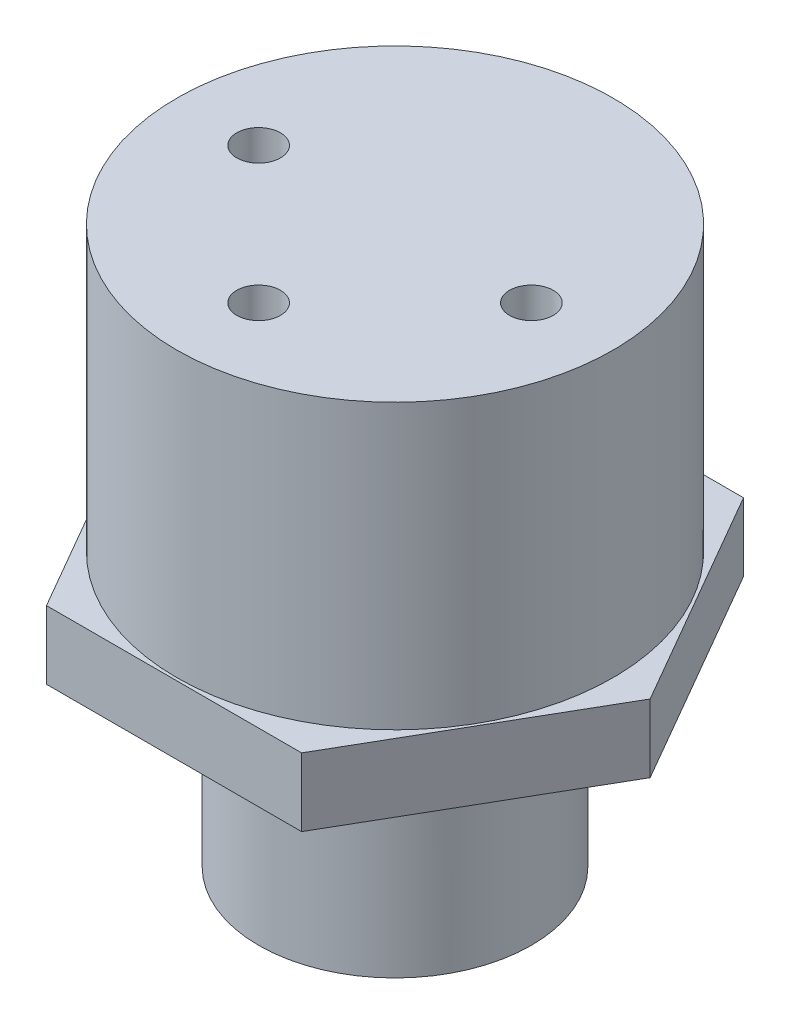
ISO-10303-21;
HEADER;
FILE_DESCRIPTION(('STEP AP214'),'2;1');
FILE_NAME('part.step','',(''),(''),'','','');
FILE_SCHEMA(('AUTOMOTIVE_DESIGN { 1 0 10303 214 1 1 1 1 }'));
ENDSEC;
DATA;
#1=APPLICATION_CONTEXT('core data for automotive mechanical design processes');
#2=APPLICATION_PROTOCOL_DEFINITION('international standard','automotive_design',2000,#1);
#3=PRODUCT_CONTEXT('',#1,'mechanical');
#4=PRODUCT('Part','Part','',(#3));
#5=PRODUCT_RELATED_PRODUCT_CATEGORY('part','',(#4));
#6=PRODUCT_DEFINITION_FORMATION('','',#4);
#7=PRODUCT_DEFINITION_CONTEXT('part definition',#1,'design');
#8=PRODUCT_DEFINITION('design','',#6,#7);
#9=PRODUCT_DEFINITION_SHAPE('','',#8);
#10=(LENGTH_UNIT() NAMED_UNIT(*) SI_UNIT(.MILLI.,.METRE.));
#11=(NAMED_UNIT(*) PLANE_ANGLE_UNIT() SI_UNIT($,.RADIAN.));
#12=(NAMED_UNIT(*) SI_UNIT($,.STERADIAN.) SOLID_ANGLE_UNIT());
#13=UNCERTAINTY_MEASURE_WITH_UNIT(LENGTH_MEASURE(1.E-05),#10,'distance_accuracy_value','');
#14=(GEOMETRIC_REPRESENTATION_CONTEXT(3) GLOBAL_UNCERTAINTY_ASSIGNED_CONTEXT((#13)) GLOBAL_UNIT_ASSIGNED_CONTEXT((#10,
#11,#12)) REPRESENTATION_CONTEXT('',''));
#15=CARTESIAN_POINT('',(0.,0.,0.));
#16=DIRECTION('',(0.,0.,1.));
#17=DIRECTION('',(1.,0.,0.));
#18=AXIS2_PLACEMENT_3D('',#15,#16,#17);
#19=CARTESIAN_POINT('',(0.,26.416,0.));
#20=DIRECTION('',(0.,1.,0.));
#21=DIRECTION('',(0.,0.,1.));
#22=AXIS2_PLACEMENT_3D('',#19,#20,#21);
#23=PLANE('',#22);
#24=CARTESIAN_POINT('',(-12.7,26.416,0.));
#25=DIRECTION('',(0.,1.,0.));
#26=DIRECTION('',(0.,0.,1.));
#27=AXIS2_PLACEMENT_3D('',#24,#25,#26);
#28=CIRCLE('',#27,2.032);
#29=CARTESIAN_POINT('',(-12.7,26.416,2.032));
#30=VERTEX_POINT('',#29);
#31=EDGE_CURVE('E205',#30,#30,#28,.T.);
#32=ORIENTED_EDGE('',*,*,#31,.F.);
#33=EDGE_LOOP('',(#32));
#34=FACE_BOUND('',#33,.T.);
#35=CARTESIAN_POINT('',(0.,26.416,0.));
#36=DIRECTION('',(0.,1.,0.));
#37=DIRECTION('',(0.,0.,1.));
#38=AXIS2_PLACEMENT_3D('',#35,#36,#37);
#39=CIRCLE('',#38,20.32);
#40=CARTESIAN_POINT('',(0.,26.416,20.32));
#41=VERTEX_POINT('',#40);
#42=EDGE_CURVE('E43',#41,#41,#39,.T.);
#43=ORIENTED_EDGE('',*,*,#42,.T.);
#44=EDGE_LOOP('',(#43));
#45=FACE_BOUND('',#44,.T.);
#46=CARTESIAN_POINT('',(0.,26.416,12.7));
#47=DIRECTION('',(0.,1.,0.));
#48=DIRECTION('',(0.,0.,1.));
#49=AXIS2_PLACEMENT_3D('',#46,#47,#48);
#50=CIRCLE('',#49,2.032);
#51=CARTESIAN_POINT('',(0.,26.416,14.732));
#52=VERTEX_POINT('',#51);
#53=EDGE_CURVE('E196',#52,#52,#50,.T.);
#54=ORIENTED_EDGE('',*,*,#53,.F.);
#55=EDGE_LOOP('',(#54));
#56=FACE_BOUND('',#55,.T.);
#57=CARTESIAN_POINT('',(12.7,26.416,0.));
#58=DIRECTION('',(0.,-1.,0.));
#59=DIRECTION('',(0.,0.,-1.));
#60=AXIS2_PLACEMENT_3D('',#57,#58,#59);
#61=CIRCLE('',#60,2.032);
#62=CARTESIAN_POINT('',(12.7,26.416,-2.032));
#63=VERTEX_POINT('',#62);
#64=EDGE_CURVE('E199',#63,#63,#61,.T.);
#65=ORIENTED_EDGE('',*,*,#64,.T.);
#66=EDGE_LOOP('',(#65));
#67=FACE_BOUND('',#66,.T.);
#68=ADVANCED_FACE('F34',(#34,#45,#56,#67),#23,.T.);
#69=CARTESIAN_POINT('',(0.,-6.35,0.));
#70=DIRECTION('',(0.,1.,0.));
#71=DIRECTION('',(0.,0.,1.));
#72=AXIS2_PLACEMENT_3D('',#69,#70,#71);
#73=PLANE('',#72);
#74=DIRECTION('',(1.,0.,0.));
#75=VECTOR('',#74,1.);
#76=CARTESIAN_POINT('',(-11.8784044383074,-6.35,20.574));
#77=LINE('',#76,#75);
#78=CARTESIAN_POINT('',(-11.8784044383074,-6.35,20.574));
#79=VERTEX_POINT('',#78);
#80=CARTESIAN_POINT('',(11.8784044383074,-6.35,20.574));
#81=VERTEX_POINT('',#80);
#82=EDGE_CURVE('E139',#79,#81,#77,.T.);
#83=ORIENTED_EDGE('',*,*,#82,.F.);
#84=DIRECTION('',(0.499999999999998,0.,0.86602540378444));
#85=VECTOR('',#84,1.);
#86=CARTESIAN_POINT('',(-23.7568088766147,-6.35,0.));
#87=LINE('',#86,#85);
#88=CARTESIAN_POINT('',(-23.7568088766147,-6.35,0.));
#89=VERTEX_POINT('',#88);
#90=EDGE_CURVE('E113',#89,#79,#87,.T.);
#91=ORIENTED_EDGE('',*,*,#90,.F.);
#92=DIRECTION('',(-0.499999999999998,0.,0.86602540378444));
#93=VECTOR('',#92,1.);
#94=CARTESIAN_POINT('',(-11.8784044383074,-6.35,-20.574));
#95=LINE('',#94,#93);
#96=CARTESIAN_POINT('',(-11.8784044383074,-6.35,-20.574));
#97=VERTEX_POINT('',#96);
#98=EDGE_CURVE('E97',#97,#89,#95,.T.);
#99=ORIENTED_EDGE('',*,*,#98,.F.);
#100=DIRECTION('',(-1.,0.,0.));
#101=VECTOR('',#100,1.);
#102=CARTESIAN_POINT('',(11.8784044383074,-6.35,-20.574));
#103=LINE('',#102,#101);
#104=CARTESIAN_POINT('',(11.8784044383074,-6.35,-20.574));
#105=VERTEX_POINT('',#104);
#106=EDGE_CURVE('E111',#105,#97,#103,.T.);
#107=ORIENTED_EDGE('',*,*,#106,.F.);
#108=DIRECTION('',(-0.499999999999998,0.,-0.86602540378444));
#109=VECTOR('',#108,1.);
#110=CARTESIAN_POINT('',(23.7568088766147,-6.35,0.));
#111=LINE('',#110,#109);
#112=CARTESIAN_POINT('',(23.7568088766147,-6.35,0.));
#113=VERTEX_POINT('',#112);
#114=EDGE_CURVE('E116',#113,#105,#111,.T.);
#115=ORIENTED_EDGE('',*,*,#114,.F.);
#116=DIRECTION('',(0.499999999999999,0.,-0.86602540378444));
#117=VECTOR('',#116,1.);
#118=CARTESIAN_POINT('',(11.8784044383074,-6.35,20.574));
#119=LINE('',#118,#117);
#120=EDGE_CURVE('E118',#81,#113,#119,.T.);
#121=ORIENTED_EDGE('',*,*,#120,.F.);
#122=EDGE_LOOP('',(#83,#91,#99,#107,#115,#121));
#123=FACE_BOUND('',#122,.T.);
#124=CARTESIAN_POINT('',(0.,-6.35,0.));
#125=DIRECTION('',(0.,1.,0.));
#126=DIRECTION('',(0.,0.,1.));
#127=AXIS2_PLACEMENT_3D('',#124,#125,#126);
#128=CIRCLE('',#127,12.7);
#129=CARTESIAN_POINT('',(0.,-6.35,12.7));
#130=VERTEX_POINT('',#129);
#131=EDGE_CURVE('E11',#130,#130,#128,.F.);
#132=ORIENTED_EDGE('',*,*,#131,.F.);
#133=EDGE_LOOP('',(#132));
#134=FACE_BOUND('',#133,.T.);
#135=ADVANCED_FACE('F108',(#123,#134),#73,.F.);
#136=CARTESIAN_POINT('',(0.,26.416,0.));
#137=DIRECTION('',(0.,-1.,0.));
#138=DIRECTION('',(0.,0.,-1.));
#139=AXIS2_PLACEMENT_3D('',#136,#137,#138);
#140=CYLINDRICAL_SURFACE('',#139,20.32);
#141=ORIENTED_EDGE('',*,*,#42,.F.);
#142=EDGE_LOOP('',(#141));
#143=FACE_BOUND('',#142,.T.);
#144=CARTESIAN_POINT('',(0.,0.,0.));
#145=DIRECTION('',(0.,1.,0.));
#146=DIRECTION('',(0.,0.,1.));
#147=AXIS2_PLACEMENT_3D('',#144,#145,#146);
#148=CIRCLE('',#147,20.32);
#149=CARTESIAN_POINT('',(0.,0.,20.32));
#150=VERTEX_POINT('',#149);
#151=EDGE_CURVE('E141',#150,#150,#148,.T.);
#152=ORIENTED_EDGE('',*,*,#151,.T.);
#153=EDGE_LOOP('',(#152));
#154=FACE_BOUND('',#153,.T.);
#155=ADVANCED_FACE('F36',(#143,#154),#140,.T.);
#156=CARTESIAN_POINT('',(0.,0.,0.));
#157=DIRECTION('',(0.,1.,0.));
#158=DIRECTION('',(0.,0.,1.));
#159=AXIS2_PLACEMENT_3D('',#156,#157,#158);
#160=PLANE('',#159);
#161=DIRECTION('',(1.,0.,0.));
#162=VECTOR('',#161,1.);
#163=CARTESIAN_POINT('',(-11.8784044383074,0.,20.574));
#164=LINE('',#163,#162);
#165=CARTESIAN_POINT('',(-11.8784044383074,0.,20.574));
#166=VERTEX_POINT('',#165);
#167=CARTESIAN_POINT('',(11.8784044383074,0.,20.574));
#168=VERTEX_POINT('',#167);
#169=EDGE_CURVE('E123',#166,#168,#164,.T.);
#170=ORIENTED_EDGE('',*,*,#169,.T.);
#171=DIRECTION('',(0.499999999999999,0.,-0.86602540378444));
#172=VECTOR('',#171,1.);
#173=CARTESIAN_POINT('',(11.8784044383074,0.,20.574));
#174=LINE('',#173,#172);
#175=CARTESIAN_POINT('',(23.7568088766147,0.,0.));
#176=VERTEX_POINT('',#175);
#177=EDGE_CURVE('E126',#168,#176,#174,.T.);
#178=ORIENTED_EDGE('',*,*,#177,.T.);
#179=DIRECTION('',(-0.499999999999998,0.,-0.86602540378444));
#180=VECTOR('',#179,1.);
#181=CARTESIAN_POINT('',(23.7568088766147,0.,0.));
#182=LINE('',#181,#180);
#183=CARTESIAN_POINT('',(11.8784044383074,0.,-20.574));
#184=VERTEX_POINT('',#183);
#185=EDGE_CURVE('E130',#176,#184,#182,.T.);
#186=ORIENTED_EDGE('',*,*,#185,.T.);
#187=DIRECTION('',(-1.,0.,0.));
#188=VECTOR('',#187,1.);
#189=CARTESIAN_POINT('',(11.8784044383074,0.,-20.574));
#190=LINE('',#189,#188);
#191=CARTESIAN_POINT('',(-11.8784044383074,0.,-20.574));
#192=VERTEX_POINT('',#191);
#193=EDGE_CURVE('E133',#184,#192,#190,.T.);
#194=ORIENTED_EDGE('',*,*,#193,.T.);
#195=DIRECTION('',(-0.499999999999998,0.,0.86602540378444));
#196=VECTOR('',#195,1.);
#197=CARTESIAN_POINT('',(-11.8784044383074,0.,-20.574));
#198=LINE('',#197,#196);
#199=CARTESIAN_POINT('',(-23.7568088766147,0.,0.));
#200=VERTEX_POINT('',#199);
#201=EDGE_CURVE('E99',#192,#200,#198,.T.);
#202=ORIENTED_EDGE('',*,*,#201,.T.);
#203=DIRECTION('',(0.499999999999998,0.,0.86602540378444));
#204=VECTOR('',#203,1.);
#205=CARTESIAN_POINT('',(-23.7568088766147,0.,0.));
#206=LINE('',#205,#204);
#207=EDGE_CURVE('E136',#200,#166,#206,.T.);
#208=ORIENTED_EDGE('',*,*,#207,.T.);
#209=EDGE_LOOP('',(#170,#178,#186,#194,#202,#208));
#210=FACE_BOUND('',#209,.T.);
#211=ORIENTED_EDGE('',*,*,#151,.F.);
#212=EDGE_LOOP('',(#211));
#213=FACE_BOUND('',#212,.T.);
#214=ADVANCED_FACE('F155',(#210,#213),#160,.T.);
#215=CARTESIAN_POINT('',(-11.8784044383074,-6.35,20.574));
#216=DIRECTION('',(0.,0.,1.));
#217=DIRECTION('',(1.,0.,0.));
#218=AXIS2_PLACEMENT_3D('',#215,#216,#217);
#219=PLANE('',#218);
#220=ORIENTED_EDGE('',*,*,#169,.F.);
#221=DIRECTION('',(0.,1.,0.));
#222=VECTOR('',#221,1.);
#223=CARTESIAN_POINT('',(-11.8784044383074,-6.35,20.574));
#224=LINE('',#223,#222);
#225=EDGE_CURVE('E51',#79,#166,#224,.T.);
#226=ORIENTED_EDGE('',*,*,#225,.F.);
#227=ORIENTED_EDGE('',*,*,#82,.T.);
#228=DIRECTION('',(0.,1.,0.));
#229=VECTOR('',#228,1.);
#230=CARTESIAN_POINT('',(11.8784044383074,-6.35,20.574));
#231=LINE('',#230,#229);
#232=EDGE_CURVE('E86',#81,#168,#231,.T.);
#233=ORIENTED_EDGE('',*,*,#232,.T.);
#234=EDGE_LOOP('',(#220,#226,#227,#233));
#235=FACE_BOUND('',#234,.T.);
#236=ADVANCED_FACE('F159',(#235),#219,.T.);
#237=CARTESIAN_POINT('',(-23.7568088766147,-6.35,0.));
#238=DIRECTION('',(-0.866025403784439,0.,0.499999999999998));
#239=DIRECTION('',(0.499999999999998,0.,0.86602540378444));
#240=AXIS2_PLACEMENT_3D('',#237,#238,#239);
#241=PLANE('',#240);
#242=ORIENTED_EDGE('',*,*,#207,.F.);
#243=DIRECTION('',(0.,1.,0.));
#244=VECTOR('',#243,1.);
#245=CARTESIAN_POINT('',(-23.7568088766147,-6.35,0.));
#246=LINE('',#245,#244);
#247=EDGE_CURVE('E74',#89,#200,#246,.T.);
#248=ORIENTED_EDGE('',*,*,#247,.F.);
#249=ORIENTED_EDGE('',*,*,#90,.T.);
#250=ORIENTED_EDGE('',*,*,#225,.T.);
#251=EDGE_LOOP('',(#242,#248,#249,#250));
#252=FACE_BOUND('',#251,.T.);
#253=ADVANCED_FACE('F165',(#252),#241,.T.);
#254=CARTESIAN_POINT('',(-11.8784044383074,-6.35,-20.574));
#255=DIRECTION('',(-0.86602540378444,0.,-0.499999999999998));
#256=DIRECTION('',(-0.499999999999998,0.,0.86602540378444));
#257=AXIS2_PLACEMENT_3D('',#254,#255,#256);
#258=PLANE('',#257);
#259=ORIENTED_EDGE('',*,*,#201,.F.);
#260=DIRECTION('',(0.,1.,0.));
#261=VECTOR('',#260,1.);
#262=CARTESIAN_POINT('',(-11.8784044383074,-6.35,-20.574));
#263=LINE('',#262,#261);
#264=EDGE_CURVE('E94',#97,#192,#263,.T.);
#265=ORIENTED_EDGE('',*,*,#264,.F.);
#266=ORIENTED_EDGE('',*,*,#98,.T.);
#267=ORIENTED_EDGE('',*,*,#247,.T.);
#268=EDGE_LOOP('',(#259,#265,#266,#267));
#269=FACE_BOUND('',#268,.T.);
#270=ADVANCED_FACE('F96',(#269),#258,.T.);
#271=CARTESIAN_POINT('',(11.8784044383074,-6.35,-20.574));
#272=DIRECTION('',(0.,0.,-1.));
#273=DIRECTION('',(-1.,0.,0.));
#274=AXIS2_PLACEMENT_3D('',#271,#272,#273);
#275=PLANE('',#274);
#276=ORIENTED_EDGE('',*,*,#193,.F.);
#277=DIRECTION('',(0.,1.,0.));
#278=VECTOR('',#277,1.);
#279=CARTESIAN_POINT('',(11.8784044383074,-6.35,-20.574));
#280=LINE('',#279,#278);
#281=EDGE_CURVE('E104',#105,#184,#280,.T.);
#282=ORIENTED_EDGE('',*,*,#281,.F.);
#283=ORIENTED_EDGE('',*,*,#106,.T.);
#284=ORIENTED_EDGE('',*,*,#264,.T.);
#285=EDGE_LOOP('',(#276,#282,#283,#284));
#286=FACE_BOUND('',#285,.T.);
#287=ADVANCED_FACE('F115',(#286),#275,.T.);
#288=CARTESIAN_POINT('',(23.7568088766147,-6.35,0.));
#289=DIRECTION('',(0.86602540378444,0.,-0.499999999999998));
#290=DIRECTION('',(-0.499999999999998,0.,-0.86602540378444));
#291=AXIS2_PLACEMENT_3D('',#288,#289,#290);
#292=PLANE('',#291);
#293=ORIENTED_EDGE('',*,*,#185,.F.);
#294=DIRECTION('',(0.,1.,0.));
#295=VECTOR('',#294,1.);
#296=CARTESIAN_POINT('',(23.7568088766147,-6.35,0.));
#297=LINE('',#296,#295);
#298=EDGE_CURVE('E144',#113,#176,#297,.T.);
#299=ORIENTED_EDGE('',*,*,#298,.F.);
#300=ORIENTED_EDGE('',*,*,#114,.T.);
#301=ORIENTED_EDGE('',*,*,#281,.T.);
#302=EDGE_LOOP('',(#293,#299,#300,#301));
#303=FACE_BOUND('',#302,.T.);
#304=ADVANCED_FACE('F180',(#303),#292,.T.);
#305=CARTESIAN_POINT('',(11.8784044383074,-6.35,20.574));
#306=DIRECTION('',(0.866025403784439,0.,0.499999999999999));
#307=DIRECTION('',(0.499999999999999,0.,-0.86602540378444));
#308=AXIS2_PLACEMENT_3D('',#305,#306,#307);
#309=PLANE('',#308);
#310=ORIENTED_EDGE('',*,*,#177,.F.);
#311=ORIENTED_EDGE('',*,*,#232,.F.);
#312=ORIENTED_EDGE('',*,*,#120,.T.);
#313=ORIENTED_EDGE('',*,*,#298,.T.);
#314=EDGE_LOOP('',(#310,#311,#312,#313));
#315=FACE_BOUND('',#314,.T.);
#316=ADVANCED_FACE('F176',(#315),#309,.T.);
#317=CARTESIAN_POINT('',(0.,-25.4,0.));
#318=DIRECTION('',(0.,1.,0.));
#319=DIRECTION('',(0.,0.,1.));
#320=AXIS2_PLACEMENT_3D('',#317,#318,#319);
#321=CYLINDRICAL_SURFACE('',#320,12.7);
#322=CARTESIAN_POINT('',(0.,-25.4,0.));
#323=DIRECTION('',(0.,-1.,0.));
#324=DIRECTION('',(0.,0.,-1.));
#325=AXIS2_PLACEMENT_3D('',#322,#323,#324);
#326=CIRCLE('',#325,12.7);
#327=CARTESIAN_POINT('',(0.,-25.4,-12.7));
#328=VERTEX_POINT('',#327);
#329=EDGE_CURVE('E127',#328,#328,#326,.T.);
#330=ORIENTED_EDGE('',*,*,#329,.F.);
#331=EDGE_LOOP('',(#330));
#332=FACE_BOUND('',#331,.T.);
#333=ORIENTED_EDGE('',*,*,#131,.T.);
#334=EDGE_LOOP('',(#333));
#335=FACE_BOUND('',#334,.T.);
#336=ADVANCED_FACE('F179',(#332,#335),#321,.T.);
#337=CARTESIAN_POINT('',(0.,-25.4,0.));
#338=DIRECTION('',(0.,-1.,0.));
#339=DIRECTION('',(0.,0.,-1.));
#340=AXIS2_PLACEMENT_3D('',#337,#338,#339);
#341=PLANE('',#340);
#342=ORIENTED_EDGE('',*,*,#329,.T.);
#343=EDGE_LOOP('',(#342));
#344=FACE_BOUND('',#343,.T.);
#345=ADVANCED_FACE('F240',(#344),#341,.T.);
#346=CARTESIAN_POINT('',(0.,16.256,12.7));
#347=DIRECTION('',(0.,1.,0.));
#348=DIRECTION('',(0.,0.,1.));
#349=AXIS2_PLACEMENT_3D('',#346,#347,#348);
#350=CYLINDRICAL_SURFACE('',#349,2.032);
#351=CARTESIAN_POINT('',(0.,16.256,12.7));
#352=DIRECTION('',(0.,1.,0.));
#353=DIRECTION('',(0.,0.,1.));
#354=AXIS2_PLACEMENT_3D('',#351,#352,#353);
#355=CIRCLE('',#354,2.032);
#356=CARTESIAN_POINT('',(0.,16.256,14.732));
#357=VERTEX_POINT('',#356);
#358=EDGE_CURVE('E195',#357,#357,#355,.T.);
#359=ORIENTED_EDGE('',*,*,#358,.F.);
#360=EDGE_LOOP('',(#359));
#361=FACE_BOUND('',#360,.T.);
#362=ORIENTED_EDGE('',*,*,#53,.T.);
#363=EDGE_LOOP('',(#362));
#364=FACE_BOUND('',#363,.T.);
#365=ADVANCED_FACE('F236',(#361,#364),#350,.F.);
#366=CARTESIAN_POINT('',(0.,16.256,12.7));
#367=DIRECTION('',(0.,1.,0.));
#368=DIRECTION('',(0.,0.,1.));
#369=AXIS2_PLACEMENT_3D('',#366,#367,#368);
#370=PLANE('',#369);
#371=ORIENTED_EDGE('',*,*,#358,.T.);
#372=EDGE_LOOP('',(#371));
#373=FACE_BOUND('',#372,.T.);
#374=ADVANCED_FACE('F231',(#373),#370,.T.);
#375=CARTESIAN_POINT('',(12.7,16.256,0.));
#376=DIRECTION('',(0.,1.,0.));
#377=DIRECTION('',(0.,0.,1.));
#378=AXIS2_PLACEMENT_3D('',#375,#376,#377);
#379=CYLINDRICAL_SURFACE('',#378,2.032);
#380=CARTESIAN_POINT('',(12.7,16.256,0.));
#381=DIRECTION('',(0.,-1.,0.));
#382=DIRECTION('',(0.,0.,-1.));
#383=AXIS2_PLACEMENT_3D('',#380,#381,#382);
#384=CIRCLE('',#383,2.032);
#385=CARTESIAN_POINT('',(12.7,16.256,-2.032));
#386=VERTEX_POINT('',#385);
#387=EDGE_CURVE('E202',#386,#386,#384,.T.);
#388=ORIENTED_EDGE('',*,*,#387,.T.);
#389=EDGE_LOOP('',(#388));
#390=FACE_BOUND('',#389,.T.);
#391=ORIENTED_EDGE('',*,*,#64,.F.);
#392=EDGE_LOOP('',(#391));
#393=FACE_BOUND('',#392,.T.);
#394=ADVANCED_FACE('F225',(#390,#393),#379,.F.);
#395=CARTESIAN_POINT('',(12.7,16.256,0.));
#396=DIRECTION('',(0.,-1.,0.));
#397=DIRECTION('',(0.,0.,-1.));
#398=AXIS2_PLACEMENT_3D('',#395,#396,#397);
#399=PLANE('',#398);
#400=ORIENTED_EDGE('',*,*,#387,.F.);
#401=EDGE_LOOP('',(#400));
#402=FACE_BOUND('',#401,.T.);
#403=ADVANCED_FACE('F216',(#402),#399,.F.);
#404=CARTESIAN_POINT('',(-12.7,16.256,0.));
#405=DIRECTION('',(0.,1.,0.));
#406=DIRECTION('',(0.,0.,1.));
#407=AXIS2_PLACEMENT_3D('',#404,#405,#406);
#408=CYLINDRICAL_SURFACE('',#407,2.032);
#409=CARTESIAN_POINT('',(-12.7,16.256,0.));
#410=DIRECTION('',(0.,1.,0.));
#411=DIRECTION('',(0.,0.,1.));
#412=AXIS2_PLACEMENT_3D('',#409,#410,#411);
#413=CIRCLE('',#412,2.032);
#414=CARTESIAN_POINT('',(-12.7,16.256,2.032));
#415=VERTEX_POINT('',#414);
#416=EDGE_CURVE('E208',#415,#415,#413,.T.);
#417=ORIENTED_EDGE('',*,*,#416,.F.);
#418=EDGE_LOOP('',(#417));
#419=FACE_BOUND('',#418,.T.);
#420=ORIENTED_EDGE('',*,*,#31,.T.);
#421=EDGE_LOOP('',(#420));
#422=FACE_BOUND('',#421,.T.);
#423=ADVANCED_FACE('F213',(#419,#422),#408,.F.);
#424=CARTESIAN_POINT('',(-12.7,16.256,0.));
#425=DIRECTION('',(0.,1.,0.));
#426=DIRECTION('',(0.,0.,1.));
#427=AXIS2_PLACEMENT_3D('',#424,#425,#426);
#428=PLANE('',#427);
#429=ORIENTED_EDGE('',*,*,#416,.T.);
#430=EDGE_LOOP('',(#429));
#431=FACE_BOUND('',#430,.T.);
#432=ADVANCED_FACE('F215',(#431),#428,.T.);
#433=CLOSED_SHELL('',(#68,#135,#155,#214,#236,#253,#270,#287,#304,#316,#336,#345,#365,#374,#394,
#403,#423,#432));
#434=MANIFOLD_SOLID_BREP('B2',#433);
#435=ADVANCED_BREP_SHAPE_REPRESENTATION('',(#18,#434),#14);
#436=SHAPE_DEFINITION_REPRESENTATION(#9,#435);
ENDSEC;
END-ISO-10303-21;
